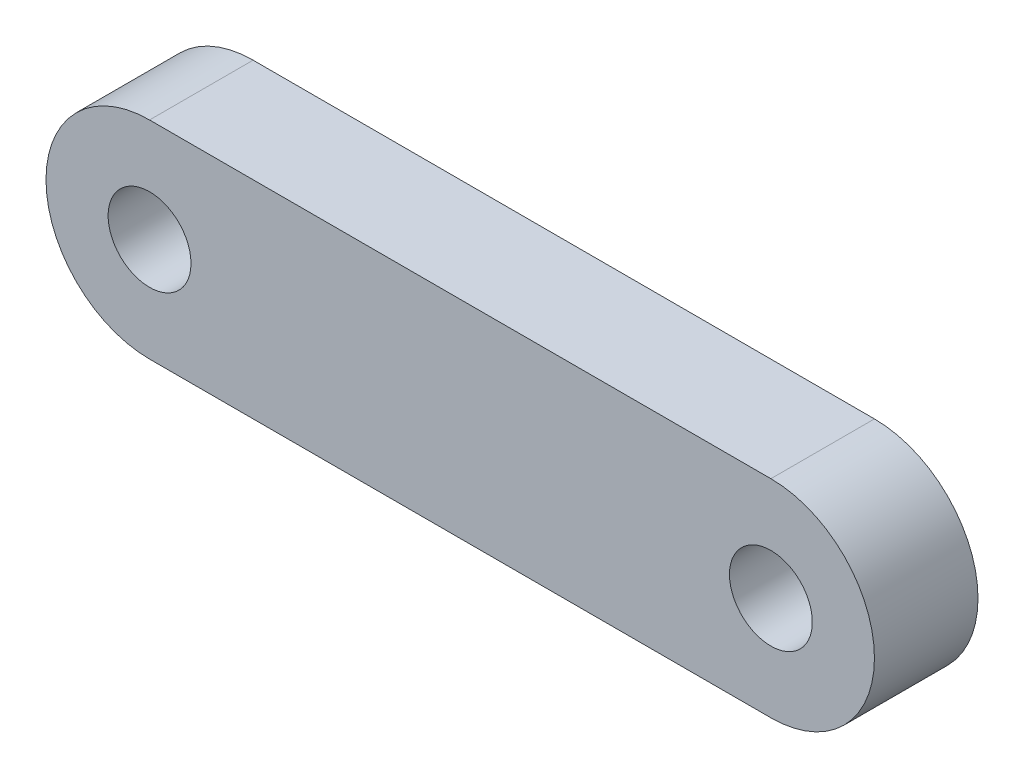
ISO-10303-21;
HEADER;
FILE_DESCRIPTION(('STEP AP214'),'2;1');
FILE_NAME('part.step','',(''),(''),'','','');
FILE_SCHEMA(('AUTOMOTIVE_DESIGN { 1 0 10303 214 1 1 1 1 }'));
ENDSEC;
DATA;
#1=APPLICATION_CONTEXT('core data for automotive mechanical design processes');
#2=APPLICATION_PROTOCOL_DEFINITION('international standard','automotive_design',2000,#1);
#3=PRODUCT_CONTEXT('',#1,'mechanical');
#4=PRODUCT('Part','Part','',(#3));
#5=PRODUCT_RELATED_PRODUCT_CATEGORY('part','',(#4));
#6=PRODUCT_DEFINITION_FORMATION('','',#4);
#7=PRODUCT_DEFINITION_CONTEXT('part definition',#1,'design');
#8=PRODUCT_DEFINITION('design','',#6,#7);
#9=PRODUCT_DEFINITION_SHAPE('','',#8);
#10=(LENGTH_UNIT() NAMED_UNIT(*) SI_UNIT(.MILLI.,.METRE.));
#11=(NAMED_UNIT(*) PLANE_ANGLE_UNIT() SI_UNIT($,.RADIAN.));
#12=(NAMED_UNIT(*) SI_UNIT($,.STERADIAN.) SOLID_ANGLE_UNIT());
#13=UNCERTAINTY_MEASURE_WITH_UNIT(LENGTH_MEASURE(1.E-05),#10,'distance_accuracy_value','');
#14=(GEOMETRIC_REPRESENTATION_CONTEXT(3) GLOBAL_UNCERTAINTY_ASSIGNED_CONTEXT((#13)) GLOBAL_UNIT_ASSIGNED_CONTEXT((#10,
#11,#12)) REPRESENTATION_CONTEXT('',''));
#15=CARTESIAN_POINT('',(0.,0.,0.));
#16=DIRECTION('',(0.,0.,1.));
#17=DIRECTION('',(1.,0.,0.));
#18=AXIS2_PLACEMENT_3D('',#15,#16,#17);
#19=CARTESIAN_POINT('',(-15.,0.,5.));
#20=DIRECTION('',(0.,0.,1.));
#21=DIRECTION('',(1.,0.,0.));
#22=AXIS2_PLACEMENT_3D('',#19,#20,#21);
#23=PLANE('',#22);
#24=CARTESIAN_POINT('',(-15.,0.,5.));
#25=DIRECTION('',(0.,0.,1.));
#26=DIRECTION('',(1.,0.,0.));
#27=AXIS2_PLACEMENT_3D('',#24,#25,#26);
#28=CIRCLE('',#27,2.);
#29=CARTESIAN_POINT('',(-13.,0.,5.));
#30=VERTEX_POINT('',#29);
#31=EDGE_CURVE('E101',#30,#30,#28,.T.);
#32=ORIENTED_EDGE('',*,*,#31,.F.);
#33=EDGE_LOOP('',(#32));
#34=FACE_BOUND('',#33,.T.);
#35=CARTESIAN_POINT('',(-15.,0.,5.));
#36=DIRECTION('',(0.,0.,1.));
#37=DIRECTION('',(1.,0.,0.));
#38=AXIS2_PLACEMENT_3D('',#35,#36,#37);
#39=CIRCLE('',#38,5.);
#40=CARTESIAN_POINT('',(-15.,5.,5.));
#41=VERTEX_POINT('',#40);
#42=CARTESIAN_POINT('',(-15.,-5.,5.));
#43=VERTEX_POINT('',#42);
#44=EDGE_CURVE('E86',#41,#43,#39,.T.);
#45=ORIENTED_EDGE('',*,*,#44,.T.);
#46=DIRECTION('',(1.,0.,0.));
#47=VECTOR('',#46,1.);
#48=CARTESIAN_POINT('',(-15.,-5.,5.));
#49=LINE('',#48,#47);
#50=CARTESIAN_POINT('',(15.,-5.,5.));
#51=VERTEX_POINT('',#50);
#52=EDGE_CURVE('E81',#43,#51,#49,.T.);
#53=ORIENTED_EDGE('',*,*,#52,.T.);
#54=CARTESIAN_POINT('',(15.,0.,5.));
#55=DIRECTION('',(0.,0.,1.));
#56=DIRECTION('',(-1.,0.,0.));
#57=AXIS2_PLACEMENT_3D('',#54,#55,#56);
#58=CIRCLE('',#57,5.);
#59=CARTESIAN_POINT('',(15.,5.,5.));
#60=VERTEX_POINT('',#59);
#61=EDGE_CURVE('E84',#51,#60,#58,.T.);
#62=ORIENTED_EDGE('',*,*,#61,.T.);
#63=DIRECTION('',(-1.,0.,0.));
#64=VECTOR('',#63,1.);
#65=CARTESIAN_POINT('',(-15.,5.,5.));
#66=LINE('',#65,#64);
#67=EDGE_CURVE('E51',#60,#41,#66,.T.);
#68=ORIENTED_EDGE('',*,*,#67,.T.);
#69=EDGE_LOOP('',(#45,#53,#62,#68));
#70=FACE_BOUND('',#69,.T.);
#71=CARTESIAN_POINT('',(15.,0.,5.));
#72=DIRECTION('',(0.,0.,1.));
#73=DIRECTION('',(-1.,0.,0.));
#74=AXIS2_PLACEMENT_3D('',#71,#72,#73);
#75=CIRCLE('',#74,2.);
#76=CARTESIAN_POINT('',(13.,0.,5.));
#77=VERTEX_POINT('',#76);
#78=EDGE_CURVE('E116',#77,#77,#75,.T.);
#79=ORIENTED_EDGE('',*,*,#78,.F.);
#80=EDGE_LOOP('',(#79));
#81=FACE_BOUND('',#80,.T.);
#82=ADVANCED_FACE('F34',(#34,#70,#81),#23,.T.);
#83=CARTESIAN_POINT('',(-15.,0.,0.));
#84=DIRECTION('',(0.,0.,1.));
#85=DIRECTION('',(1.,0.,0.));
#86=AXIS2_PLACEMENT_3D('',#83,#84,#85);
#87=PLANE('',#86);
#88=CARTESIAN_POINT('',(-15.,0.,0.));
#89=DIRECTION('',(0.,0.,1.));
#90=DIRECTION('',(1.,0.,0.));
#91=AXIS2_PLACEMENT_3D('',#88,#89,#90);
#92=CIRCLE('',#91,5.);
#93=CARTESIAN_POINT('',(-15.,5.,0.));
#94=VERTEX_POINT('',#93);
#95=CARTESIAN_POINT('',(-15.,-5.,0.));
#96=VERTEX_POINT('',#95);
#97=EDGE_CURVE('E98',#94,#96,#92,.T.);
#98=ORIENTED_EDGE('',*,*,#97,.F.);
#99=DIRECTION('',(-1.,0.,0.));
#100=VECTOR('',#99,1.);
#101=CARTESIAN_POINT('',(-15.,5.,0.));
#102=LINE('',#101,#100);
#103=CARTESIAN_POINT('',(15.,5.,0.));
#104=VERTEX_POINT('',#103);
#105=EDGE_CURVE('E74',#104,#94,#102,.T.);
#106=ORIENTED_EDGE('',*,*,#105,.F.);
#107=CARTESIAN_POINT('',(15.,0.,0.));
#108=DIRECTION('',(0.,0.,1.));
#109=DIRECTION('',(-1.,0.,0.));
#110=AXIS2_PLACEMENT_3D('',#107,#108,#109);
#111=CIRCLE('',#110,5.);
#112=CARTESIAN_POINT('',(15.,-5.,0.));
#113=VERTEX_POINT('',#112);
#114=EDGE_CURVE('E68',#113,#104,#111,.T.);
#115=ORIENTED_EDGE('',*,*,#114,.F.);
#116=DIRECTION('',(1.,0.,0.));
#117=VECTOR('',#116,1.);
#118=CARTESIAN_POINT('',(-15.,-5.,0.));
#119=LINE('',#118,#117);
#120=EDGE_CURVE('E90',#96,#113,#119,.T.);
#121=ORIENTED_EDGE('',*,*,#120,.F.);
#122=EDGE_LOOP('',(#98,#106,#115,#121));
#123=FACE_BOUND('',#122,.T.);
#124=CARTESIAN_POINT('',(-15.,0.,0.));
#125=DIRECTION('',(0.,0.,1.));
#126=DIRECTION('',(1.,0.,0.));
#127=AXIS2_PLACEMENT_3D('',#124,#125,#126);
#128=CIRCLE('',#127,2.);
#129=CARTESIAN_POINT('',(-13.,0.,0.));
#130=VERTEX_POINT('',#129);
#131=EDGE_CURVE('E113',#130,#130,#128,.T.);
#132=ORIENTED_EDGE('',*,*,#131,.T.);
#133=EDGE_LOOP('',(#132));
#134=FACE_BOUND('',#133,.T.);
#135=CARTESIAN_POINT('',(15.,0.,0.));
#136=DIRECTION('',(0.,0.,1.));
#137=DIRECTION('',(-1.,0.,0.));
#138=AXIS2_PLACEMENT_3D('',#135,#136,#137);
#139=CIRCLE('',#138,2.);
#140=CARTESIAN_POINT('',(13.,0.,0.));
#141=VERTEX_POINT('',#140);
#142=EDGE_CURVE('E119',#141,#141,#139,.T.);
#143=ORIENTED_EDGE('',*,*,#142,.T.);
#144=EDGE_LOOP('',(#143));
#145=FACE_BOUND('',#144,.T.);
#146=ADVANCED_FACE('F109',(#123,#134,#145),#87,.F.);
#147=CARTESIAN_POINT('',(-15.,0.,5.));
#148=DIRECTION('',(0.,0.,-1.));
#149=DIRECTION('',(-1.,0.,0.));
#150=AXIS2_PLACEMENT_3D('',#147,#148,#149);
#151=CYLINDRICAL_SURFACE('',#150,5.);
#152=ORIENTED_EDGE('',*,*,#97,.T.);
#153=DIRECTION('',(0.,0.,-1.));
#154=VECTOR('',#153,1.);
#155=CARTESIAN_POINT('',(-15.,-5.,5.));
#156=LINE('',#155,#154);
#157=EDGE_CURVE('E11',#43,#96,#156,.T.);
#158=ORIENTED_EDGE('',*,*,#157,.F.);
#159=ORIENTED_EDGE('',*,*,#44,.F.);
#160=DIRECTION('',(0.,0.,-1.));
#161=VECTOR('',#160,1.);
#162=CARTESIAN_POINT('',(-15.,5.,5.));
#163=LINE('',#162,#161);
#164=EDGE_CURVE('E94',#41,#94,#163,.T.);
#165=ORIENTED_EDGE('',*,*,#164,.T.);
#166=EDGE_LOOP('',(#152,#158,#159,#165));
#167=FACE_BOUND('',#166,.T.);
#168=ADVANCED_FACE('F36',(#167),#151,.T.);
#169=CARTESIAN_POINT('',(-15.,-5.,5.));
#170=DIRECTION('',(0.,1.,0.));
#171=DIRECTION('',(0.,0.,1.));
#172=AXIS2_PLACEMENT_3D('',#169,#170,#171);
#173=PLANE('',#172);
#174=ORIENTED_EDGE('',*,*,#120,.T.);
#175=DIRECTION('',(0.,0.,-1.));
#176=VECTOR('',#175,1.);
#177=CARTESIAN_POINT('',(15.,-5.,5.));
#178=LINE('',#177,#176);
#179=EDGE_CURVE('E43',#51,#113,#178,.T.);
#180=ORIENTED_EDGE('',*,*,#179,.F.);
#181=ORIENTED_EDGE('',*,*,#52,.F.);
#182=ORIENTED_EDGE('',*,*,#157,.T.);
#183=EDGE_LOOP('',(#174,#180,#181,#182));
#184=FACE_BOUND('',#183,.T.);
#185=ADVANCED_FACE('F89',(#184),#173,.F.);
#186=CARTESIAN_POINT('',(15.,0.,5.));
#187=DIRECTION('',(0.,0.,-1.));
#188=DIRECTION('',(-1.,0.,0.));
#189=AXIS2_PLACEMENT_3D('',#186,#187,#188);
#190=CYLINDRICAL_SURFACE('',#189,5.);
#191=ORIENTED_EDGE('',*,*,#114,.T.);
#192=DIRECTION('',(0.,0.,-1.));
#193=VECTOR('',#192,1.);
#194=CARTESIAN_POINT('',(15.,5.,5.));
#195=LINE('',#194,#193);
#196=EDGE_CURVE('E91',#60,#104,#195,.T.);
#197=ORIENTED_EDGE('',*,*,#196,.F.);
#198=ORIENTED_EDGE('',*,*,#61,.F.);
#199=ORIENTED_EDGE('',*,*,#179,.T.);
#200=EDGE_LOOP('',(#191,#197,#198,#199));
#201=FACE_BOUND('',#200,.T.);
#202=ADVANCED_FACE('F92',(#201),#190,.T.);
#203=CARTESIAN_POINT('',(-15.,5.,5.));
#204=DIRECTION('',(0.,-1.,0.));
#205=DIRECTION('',(0.,0.,-1.));
#206=AXIS2_PLACEMENT_3D('',#203,#204,#205);
#207=PLANE('',#206);
#208=ORIENTED_EDGE('',*,*,#105,.T.);
#209=ORIENTED_EDGE('',*,*,#164,.F.);
#210=ORIENTED_EDGE('',*,*,#67,.F.);
#211=ORIENTED_EDGE('',*,*,#196,.T.);
#212=EDGE_LOOP('',(#208,#209,#210,#211));
#213=FACE_BOUND('',#212,.T.);
#214=ADVANCED_FACE('F106',(#213),#207,.F.);
#215=CARTESIAN_POINT('',(-15.,0.,5.));
#216=DIRECTION('',(0.,0.,-1.));
#217=DIRECTION('',(-1.,0.,0.));
#218=AXIS2_PLACEMENT_3D('',#215,#216,#217);
#219=CYLINDRICAL_SURFACE('',#218,2.);
#220=ORIENTED_EDGE('',*,*,#31,.T.);
#221=EDGE_LOOP('',(#220));
#222=FACE_BOUND('',#221,.T.);
#223=ORIENTED_EDGE('',*,*,#131,.F.);
#224=EDGE_LOOP('',(#223));
#225=FACE_BOUND('',#224,.T.);
#226=ADVANCED_FACE('F136',(#222,#225),#219,.F.);
#227=CARTESIAN_POINT('',(15.,0.,5.));
#228=DIRECTION('',(0.,0.,-1.));
#229=DIRECTION('',(-1.,0.,0.));
#230=AXIS2_PLACEMENT_3D('',#227,#228,#229);
#231=CYLINDRICAL_SURFACE('',#230,2.);
#232=ORIENTED_EDGE('',*,*,#78,.T.);
#233=EDGE_LOOP('',(#232));
#234=FACE_BOUND('',#233,.T.);
#235=ORIENTED_EDGE('',*,*,#142,.F.);
#236=EDGE_LOOP('',(#235));
#237=FACE_BOUND('',#236,.T.);
#238=ADVANCED_FACE('F125',(#234,#237),#231,.F.);
#239=CLOSED_SHELL('',(#82,#146,#168,#185,#202,#214,#226,#238));
#240=MANIFOLD_SOLID_BREP('B2',#239);
#241=ADVANCED_BREP_SHAPE_REPRESENTATION('',(#18,#240),#14);
#242=SHAPE_DEFINITION_REPRESENTATION(#9,#241);
ENDSEC;
END-ISO-10303-21;
